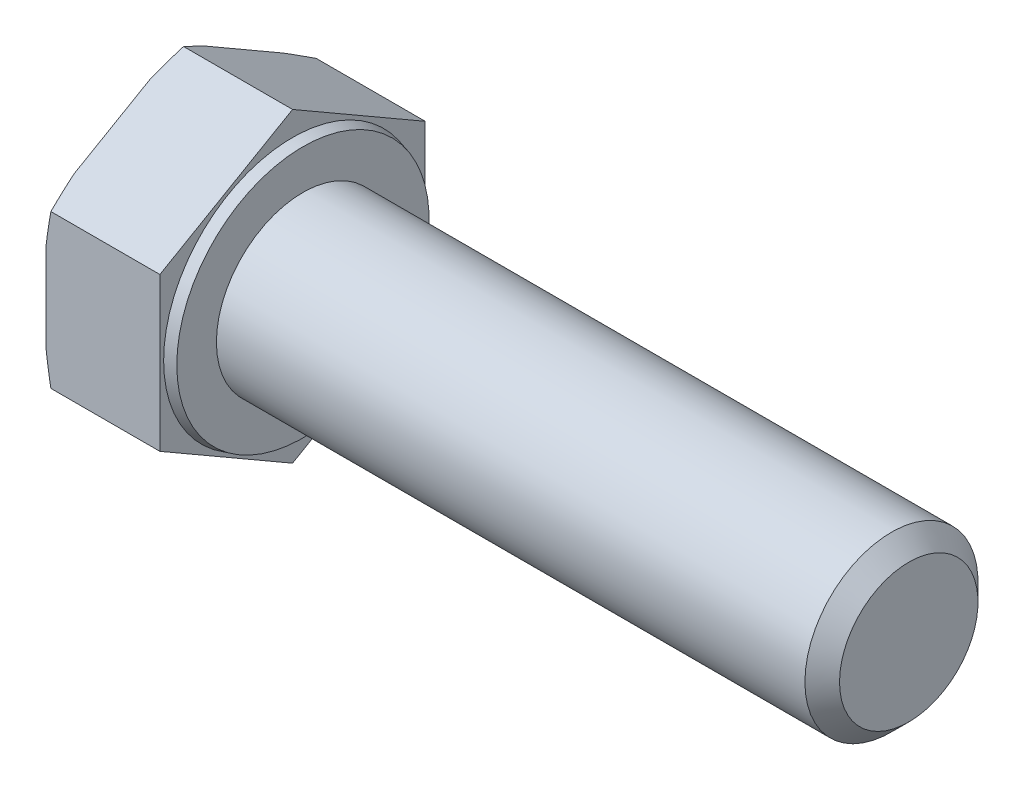
ISO-10303-21;
HEADER;
FILE_DESCRIPTION(('STEP AP214'),'2;1');
FILE_NAME('part.step','',(''),(''),'','','');
FILE_SCHEMA(('AUTOMOTIVE_DESIGN { 1 0 10303 214 1 1 1 1 }'));
ENDSEC;
DATA;
#1=APPLICATION_CONTEXT('core data for automotive mechanical design processes');
#2=APPLICATION_PROTOCOL_DEFINITION('international standard','automotive_design',2000,#1);
#3=PRODUCT_CONTEXT('',#1,'mechanical');
#4=PRODUCT('Part','Part','',(#3));
#5=PRODUCT_RELATED_PRODUCT_CATEGORY('part','',(#4));
#6=PRODUCT_DEFINITION_FORMATION('','',#4);
#7=PRODUCT_DEFINITION_CONTEXT('part definition',#1,'design');
#8=PRODUCT_DEFINITION('design','',#6,#7);
#9=PRODUCT_DEFINITION_SHAPE('','',#8);
#10=(LENGTH_UNIT() NAMED_UNIT(*) SI_UNIT(.MILLI.,.METRE.));
#11=(NAMED_UNIT(*) PLANE_ANGLE_UNIT() SI_UNIT($,.RADIAN.));
#12=(NAMED_UNIT(*) SI_UNIT($,.STERADIAN.) SOLID_ANGLE_UNIT());
#13=UNCERTAINTY_MEASURE_WITH_UNIT(LENGTH_MEASURE(1.E-05),#10,'distance_accuracy_value','');
#14=(GEOMETRIC_REPRESENTATION_CONTEXT(3) GLOBAL_UNCERTAINTY_ASSIGNED_CONTEXT((#13)) GLOBAL_UNIT_ASSIGNED_CONTEXT((#10,
#11,#12)) REPRESENTATION_CONTEXT('',''));
#15=CARTESIAN_POINT('',(0.,0.,0.));
#16=DIRECTION('',(0.,0.,1.));
#17=DIRECTION('',(1.,0.,0.));
#18=AXIS2_PLACEMENT_3D('',#15,#16,#17);
#19=CARTESIAN_POINT('',(35.6000000000001,-4.42500000000009,-7.66432482349223));
#20=DIRECTION('',(0.,-0.866025403784442,-0.499999999999995));
#21=DIRECTION('',(0.,0.499999999999995,-0.866025403784442));
#22=AXIS2_PLACEMENT_3D('',#19,#20,#21);
#23=PLANE('',#22);
#24=DIRECTION('',(-1.,0.,0.));
#25=VECTOR('',#24,1.);
#26=CARTESIAN_POINT('',(35.6000000000001,-8.85,0.));
#27=LINE('',#26,#25);
#28=CARTESIAN_POINT('',(0.,-8.85,0.));
#29=VERTEX_POINT('',#28);
#30=CARTESIAN_POINT('',(-6.29792306844368,-8.85,0.));
#31=VERTEX_POINT('',#30);
#32=EDGE_CURVE('E163',#29,#31,#27,.T.);
#33=ORIENTED_EDGE('',*,*,#32,.T.);
#34=CARTESIAN_POINT('',(-4.7699615006699,-11.9174022332107,5.3128965151713));
#35=CARTESIAN_POINT('',(-4.83614833570257,-11.8050473190038,5.11829209528478));
#36=CARTESIAN_POINT('',(-4.90167255003095,-11.6925948603644,4.92351872348535));
#37=CARTESIAN_POINT('',(-5.03118559698242,-11.4674663528304,4.53358471020429));
#38=CARTESIAN_POINT('',(-5.09517439305191,-11.3547902986816,4.33842405962226));
#39=CARTESIAN_POINT('',(-5.28456041407138,-11.0163157536771,3.75216895060564));
#40=CARTESIAN_POINT('',(-5.40733223857273,-10.7901468045143,3.3604328395613));
#41=CARTESIAN_POINT('',(-5.64480594732521,-10.3342684187143,2.57082831328319));
#42=CARTESIAN_POINT('',(-5.75941225873481,-10.1045464495324,2.17293819104533));
#43=CARTESIAN_POINT('',(-5.97591685440881,-9.6436033227612,1.37456127607789));
#44=CARTESIAN_POINT('',(-6.07781581130404,-9.41238224520544,0.974074621970502));
#45=CARTESIAN_POINT('',(-6.26134144326315,-8.95638364479248,0.184261877874948));
#46=CARTESIAN_POINT('',(-6.34355573274743,-8.73166601658844,-0.204960471530833));
#47=CARTESIAN_POINT('',(-6.48746045966098,-8.28055127837509,-0.986314118159495));
#48=CARTESIAN_POINT('',(-6.54915189984519,-8.05415425097466,-1.37844527229962));
#49=CARTESIAN_POINT('',(-6.62254434564547,-7.71410474496151,-1.9674282938031));
#50=CARTESIAN_POINT('',(-6.64378861584913,-7.60095958105454,-2.16340146632069));
#51=CARTESIAN_POINT('',(-6.67950592063896,-7.37440457175731,-2.55580625313272));
#52=CARTESIAN_POINT('',(-6.69397933196105,-7.26099474144627,-2.75223784130922));
#53=CARTESIAN_POINT('',(-6.7157765759338,-7.03401139991638,-3.14538452131075));
#54=CARTESIAN_POINT('',(-6.72310096885371,-6.92043790222291,-3.34209958970915));
#55=CARTESIAN_POINT('',(-6.73040192529392,-6.69323186195545,-3.73563199523894));
#56=CARTESIAN_POINT('',(-6.73037853713207,-6.57959931977464,-3.93244933168932));
#57=CARTESIAN_POINT('',(-6.72320871548941,-6.35929562962563,-4.31402651612232));
#58=CARTESIAN_POINT('',(-6.71649505277964,-6.25262090601261,-4.49879255730344));
#59=CARTESIAN_POINT('',(-6.69675463432834,-6.03941600442701,-4.86807427927243));
#60=CARTESIAN_POINT('',(-6.68372760236287,-5.93288583298343,-5.05258994875173));
#61=CARTESIAN_POINT('',(-6.63559663675346,-5.61363013252953,-5.60555704254388));
#62=CARTESIAN_POINT('',(-6.59144268713134,-5.40123548697151,-5.97343535990596));
#63=CARTESIAN_POINT('',(-6.48226269320506,-4.97681311893132,-6.70855646522027));
#64=CARTESIAN_POINT('',(-6.41713860156276,-4.7647919199632,-7.07578795411474));
#65=CARTESIAN_POINT('',(-6.27018625376656,-4.34222339340586,-7.80769811179158));
#66=CARTESIAN_POINT('',(-6.18835790112246,-4.1316760743376,-8.17237676581522));
#67=CARTESIAN_POINT('',(-6.00866271800198,-3.70472589760515,-8.91187616421634));
#68=CARTESIAN_POINT('',(-5.91033992742069,-3.48837165185492,-9.286612710289));
#69=CARTESIAN_POINT('',(-5.70311989656312,-3.05693413716248,-10.0338844060276));
#70=CARTESIAN_POINT('',(-5.59422212603359,-2.84185093252738,-10.4064194443103));
#71=CARTESIAN_POINT('',(-5.36943684134144,-2.41473283183158,-11.1462096955477));
#72=CARTESIAN_POINT('',(-5.25362330968472,-2.2026881429877,-11.5134818701005));
#73=CARTESIAN_POINT('',(-5.07537550670142,-1.88529185166037,-12.0632283728134));
#74=CARTESIAN_POINT('',(-5.01521325258259,-1.77961882394802,-12.2462594258008));
#75=CARTESIAN_POINT('',(-4.89354912869936,-1.56846779942573,-12.6119837283436));
#76=CARTESIAN_POINT('',(-4.83204728425027,-1.462989798971,-12.794676984212));
#77=CARTESIAN_POINT('',(-4.7699615006699,-1.35759776678936,-12.9772213386635));
#78=B_SPLINE_CURVE_WITH_KNOTS('',3,(#34,#35,#36,#37,#38,#39,#40,#41,#42,#43,#44,#45,#46,#47,#48,
#49,#50,#51,#52,#53,#54,#55,#56,#57,#58,#59,#60,#61,#62,#63,#64,#65,#66,#67,#68,#69,#70,#71,#72,
#73,#74,#75,#76,#77),.UNSPECIFIED.,.F.,.F.,(4,2,2,2,2,2,2,2,2,2,2,2,2,2,2,2,2,2,2,2,2,4),(0.,
0.70276173034238,1.40554017472233,2.81157217612387,4.23201032618944,5.6523732571052,
7.02270828812482,8.39297635416767,9.07474696516834,9.75647963740092,10.438158877887,
11.119833635759,11.7601005309412,12.4003954417532,13.6809617128842,14.9676044823533,
16.2542546841746,17.5852978857349,18.9164078632869,20.2352036230902,20.894426976119,
21.553637882061),.UNSPECIFIED.);
#79=CARTESIAN_POINT('',(-6.58000000000003,-7.90869530364146,-1.63038755949604));
#80=VERTEX_POINT('',#79);
#81=EDGE_CURVE('E208',#31,#80,#78,.T.);
#82=ORIENTED_EDGE('',*,*,#81,.T.);
#83=DIRECTION('',(0.,-0.499999999999995,0.866025403784442));
#84=VECTOR('',#83,1.);
#85=CARTESIAN_POINT('',(-6.58,-4.42500000000009,-7.66432482349223));
#86=LINE('',#85,#84);
#87=CARTESIAN_POINT('',(-6.58,-5.36630469635854,-6.03393726399618));
#88=VERTEX_POINT('',#87);
#89=EDGE_CURVE('E218',#88,#80,#86,.T.);
#90=ORIENTED_EDGE('',*,*,#89,.F.);
#91=CARTESIAN_POINT('',(-6.29792306844368,-4.42500000000009,-7.66432482349223));
#92=VERTEX_POINT('',#91);
#93=EDGE_CURVE('E221',#88,#92,#78,.T.);
#94=ORIENTED_EDGE('',*,*,#93,.T.);
#95=DIRECTION('',(-1.,0.,0.));
#96=VECTOR('',#95,1.);
#97=CARTESIAN_POINT('',(35.6000000000001,-4.42500000000009,-7.66432482349223));
#98=LINE('',#97,#96);
#99=CARTESIAN_POINT('',(0.,-4.42500000000009,-7.66432482349223));
#100=VERTEX_POINT('',#99);
#101=EDGE_CURVE('E174',#100,#92,#98,.T.);
#102=ORIENTED_EDGE('',*,*,#101,.F.);
#103=DIRECTION('',(0.,-0.499999999999995,0.866025403784442));
#104=VECTOR('',#103,1.);
#105=CARTESIAN_POINT('',(0.,-4.42500000000009,-7.66432482349223));
#106=LINE('',#105,#104);
#107=EDGE_CURVE('E189',#100,#29,#106,.T.);
#108=ORIENTED_EDGE('',*,*,#107,.T.);
#109=EDGE_LOOP('',(#33,#82,#90,#94,#102,#108));
#110=FACE_BOUND('',#109,.T.);
#111=ADVANCED_FACE('F41',(#110),#23,.T.);
#112=CARTESIAN_POINT('',(35.6000000000001,4.42499999999993,-7.66432482349232));
#113=DIRECTION('',(0.,0.,-1.));
#114=DIRECTION('',(0.,1.,0.));
#115=AXIS2_PLACEMENT_3D('',#112,#113,#114);
#116=PLANE('',#115);
#117=ORIENTED_EDGE('',*,*,#101,.T.);
#118=CARTESIAN_POINT('',(-5.00864005639831,-9.73789651517145,-7.66432482349217));
#119=CARTESIAN_POINT('',(-5.07003318744064,-9.52322769233334,-7.66432482349218));
#120=CARTESIAN_POINT('',(-5.13071664914256,-9.30835600664128,-7.66432482349218));
#121=CARTESIAN_POINT('',(-5.2504442425723,-8.87815277711283,-7.66432482349218));
#122=CARTESIAN_POINT('',(-5.30948834652955,-8.66282122555281,-7.66432482349219));
#123=CARTESIAN_POINT('',(-5.48387527888684,-8.01589307910885,-7.66432482349219));
#124=CARTESIAN_POINT('',(-5.59642298983084,-7.58353558067021,-7.6643248234922));
#125=CARTESIAN_POINT('',(-5.81266226723173,-6.71259000391773,-7.66432482349221));
#126=CARTESIAN_POINT('',(-5.91626806915323,-6.27398046842187,-7.66432482349221));
#127=CARTESIAN_POINT('',(-6.11029091280608,-5.39384656433909,-7.66432482349222));
#128=CARTESIAN_POINT('',(-6.20070892550878,-4.95232241284974,-7.66432482349222));
#129=CARTESIAN_POINT('',(-6.36160933963008,-4.08051166755351,-7.66432482349223));
#130=CARTESIAN_POINT('',(-6.43264625776086,-3.65032885049375,-7.66432482349224));
#131=CARTESIAN_POINT('',(-6.55428187483288,-2.78707107422335,-7.66432482349225));
#132=CARTESIAN_POINT('',(-6.60488453148917,-2.35399669158535,-7.66432482349225));
#133=CARTESIAN_POINT('',(-6.66240831794471,-1.70368188145931,-7.66432482349226));
#134=CARTESIAN_POINT('',(-6.67850532779577,-1.48723464984804,-7.66432482349226));
#135=CARTESIAN_POINT('',(-6.70429433272965,-1.05396299728827,-7.66432482349227));
#136=CARTESIAN_POINT('',(-6.71398664875919,-0.837138595786226,-7.66432482349227));
#137=CARTESIAN_POINT('',(-6.72672253024382,-0.403302294793051,-7.66432482349227));
#138=CARTESIAN_POINT('',(-6.72976638437883,-0.186290403852155,-7.66432482349227));
#139=CARTESIAN_POINT('',(-6.7291358967764,0.247718950123678,-7.66432482349228));
#140=CARTESIAN_POINT('',(-6.72546155695146,0.464716413162706,-7.66432482349228));
#141=CARTESIAN_POINT('',(-6.70624362970486,1.06036953223341,-7.66432482349229));
#142=CARTESIAN_POINT('',(-6.68388895075078,1.43882252598365,-7.66432482349229));
#143=CARTESIAN_POINT('',(-6.62050559151052,2.19412494594648,-7.6643248234923));
#144=CARTESIAN_POINT('',(-6.57947609181733,2.57097430106276,-7.6643248234923));
#145=CARTESIAN_POINT('',(-6.48113797206862,3.32388976987407,-7.66432482349231));
#146=CARTESIAN_POINT('',(-6.4237712185853,3.69994816672772,-7.66432482349232));
#147=CARTESIAN_POINT('',(-6.2956564145037,4.44978573942378,-7.66432482349232));
#148=CARTESIAN_POINT('',(-6.22490691200718,4.82356466341955,-7.66432482349233));
#149=CARTESIAN_POINT('',(-6.0704014797458,5.58003633732887,-7.66432482349234));
#150=CARTESIAN_POINT('',(-5.98632024183774,5.96266195818458,-7.66432482349234));
#151=CARTESIAN_POINT('',(-5.80919867667365,6.72583533235177,-7.66432482349235));
#152=CARTESIAN_POINT('',(-5.71615790531566,7.10638298167437,-7.66432482349235));
#153=CARTESIAN_POINT('',(-5.52374117974904,7.86297645537245,-7.66432482349236));
#154=CARTESIAN_POINT('',(-5.42441511026811,8.23903503370974,-7.66432482349236));
#155=CARTESIAN_POINT('',(-5.27134102225385,8.80195695976291,-7.66432482349237));
#156=CARTESIAN_POINT('',(-5.21964171692946,8.98938164843282,-7.66432482349237));
#157=CARTESIAN_POINT('',(-5.11502150400523,9.36388780999383,-7.66432482349237));
#158=CARTESIAN_POINT('',(-5.06210060924165,9.55096928646908,-7.66432482349238));
#159=CARTESIAN_POINT('',(-5.00864005639831,9.73789651517129,-7.66432482349238));
#160=B_SPLINE_CURVE_WITH_KNOTS('',3,(#118,#119,#120,#121,#122,#123,#124,#125,#126,#127,#128,
#129,#130,#131,#132,#133,#134,#135,#136,#137,#138,#139,#140,#141,#142,#143,#144,#145,#146,#147,
#148,#149,#150,#151,#152,#153,#154,#155,#156,#157,#158,#159),.UNSPECIFIED.,.F.,.F.,(4,2,2,2,2,2,
2,2,2,2,2,2,2,2,2,2,2,2,2,2,4),(0.,0.669823290546161,1.33965792092904,2.67986595636369,
4.03175825312792,5.38355096443301,6.69120700403605,7.99860965473741,8.64966414612008,
9.300686009923,9.95167960543101,10.6026730156168,11.7394565125237,12.876289893615,
14.0172201663474,15.1582742899967,16.3334026116279,17.5085892114817,18.6753990362947,
19.2586689197893,19.8419326771629),.UNSPECIFIED.);
#161=CARTESIAN_POINT('',(-6.58000000000003,-2.54239060728318,-7.66432482349217));
#162=VERTEX_POINT('',#161);
#163=EDGE_CURVE('E229',#92,#162,#160,.T.);
#164=ORIENTED_EDGE('',*,*,#163,.T.);
#165=DIRECTION('',(0.,-1.,0.));
#166=VECTOR('',#165,1.);
#167=CARTESIAN_POINT('',(-6.58,4.42499999999993,-7.66432482349232));
#168=LINE('',#167,#166);
#169=CARTESIAN_POINT('',(-6.58,2.54239060728305,-7.6643248234923));
#170=VERTEX_POINT('',#169);
#171=EDGE_CURVE('E169',#170,#162,#168,.T.);
#172=ORIENTED_EDGE('',*,*,#171,.F.);
#173=CARTESIAN_POINT('',(-6.29792306844368,4.42499999999993,-7.66432482349233));
#174=VERTEX_POINT('',#173);
#175=EDGE_CURVE('E56',#170,#174,#160,.T.);
#176=ORIENTED_EDGE('',*,*,#175,.T.);
#177=DIRECTION('',(-1.,0.,0.));
#178=VECTOR('',#177,1.);
#179=CARTESIAN_POINT('',(35.6000000000001,4.42499999999993,-7.66432482349232));
#180=LINE('',#179,#178);
#181=CARTESIAN_POINT('',(0.,4.42499999999993,-7.66432482349232));
#182=VERTEX_POINT('',#181);
#183=EDGE_CURVE('E160',#182,#174,#180,.T.);
#184=ORIENTED_EDGE('',*,*,#183,.F.);
#185=DIRECTION('',(0.,-1.,0.));
#186=VECTOR('',#185,1.);
#187=CARTESIAN_POINT('',(0.,8.84999999999992,-7.66432482349237));
#188=LINE('',#187,#186);
#189=EDGE_CURVE('E187',#182,#100,#188,.T.);
#190=ORIENTED_EDGE('',*,*,#189,.T.);
#191=EDGE_LOOP('',(#117,#164,#172,#176,#184,#190));
#192=FACE_BOUND('',#191,.T.);
#193=ADVANCED_FACE('F256',(#192),#116,.T.);
#194=CARTESIAN_POINT('',(35.6000000000001,8.85,0.));
#195=DIRECTION('',(0.,0.866025403784434,-0.500000000000007));
#196=DIRECTION('',(0.,0.500000000000007,0.866025403784435));
#197=AXIS2_PLACEMENT_3D('',#194,#195,#196);
#198=PLANE('',#197);
#199=ORIENTED_EDGE('',*,*,#183,.T.);
#200=CARTESIAN_POINT('',(-4.76996150066986,1.35759776678906,-12.9772213386637));
#201=CARTESIAN_POINT('',(-4.83614833570253,1.46995268099604,-12.7826169187772));
#202=CARTESIAN_POINT('',(-4.90167255003091,1.58240513963541,-12.5878435469777));
#203=CARTESIAN_POINT('',(-5.03118559698238,1.80753364716942,-12.1979095336967));
#204=CARTESIAN_POINT('',(-5.09517439305187,1.92020970131819,-12.0027488831146));
#205=CARTESIAN_POINT('',(-5.28456041407135,2.25868424632273,-11.416493774098));
#206=CARTESIAN_POINT('',(-5.40733223857269,2.48485319548548,-11.0247576630537));
#207=CARTESIAN_POINT('',(-5.64480594732518,2.9407315812855,-10.2351531367756));
#208=CARTESIAN_POINT('',(-5.75941225873478,3.17045355046743,-9.83726301453771));
#209=CARTESIAN_POINT('',(-5.97591685440879,3.63139667723867,-9.03888609957028));
#210=CARTESIAN_POINT('',(-6.07781581130402,3.86261775479443,-8.63839944546289));
#211=CARTESIAN_POINT('',(-6.26134144326313,4.3186163552074,-7.84858670136733));
#212=CARTESIAN_POINT('',(-6.34355573274742,4.54333398341145,-7.45936435196155));
#213=CARTESIAN_POINT('',(-6.48746045966097,4.99444872162481,-6.67801070533289));
#214=CARTESIAN_POINT('',(-6.54915189984519,5.22084574902526,-6.28587955119277));
#215=CARTESIAN_POINT('',(-6.62254434564547,5.56089525503842,-5.69689652968929));
#216=CARTESIAN_POINT('',(-6.64378861584913,5.67404041894539,-5.5009233571717));
#217=CARTESIAN_POINT('',(-6.67950592063896,5.90059542824263,-5.10851857035966));
#218=CARTESIAN_POINT('',(-6.69397933196106,6.01400525855367,-4.91208698218317));
#219=CARTESIAN_POINT('',(-6.7157765759338,6.24098860008357,-4.51894030218163));
#220=CARTESIAN_POINT('',(-6.72310096885372,6.35456209777704,-4.32222523378324));
#221=CARTESIAN_POINT('',(-6.73040192529394,6.58176813804451,-3.92869282825345));
#222=CARTESIAN_POINT('',(-6.73037853713208,6.69540068022533,-3.73187549180306));
#223=CARTESIAN_POINT('',(-6.72320871548943,6.91570437037435,-3.35029830737006));
#224=CARTESIAN_POINT('',(-6.71649505277966,7.02237909398737,-3.16553226618893));
#225=CARTESIAN_POINT('',(-6.69675463432836,7.23558399557298,-2.79625054421994));
#226=CARTESIAN_POINT('',(-6.68372760236289,7.34211416701656,-2.61173487474064));
#227=CARTESIAN_POINT('',(-6.63559663675348,7.66136986747048,-2.05876778094847));
#228=CARTESIAN_POINT('',(-6.59144268713136,7.87376451302852,-1.69088946358639));
#229=CARTESIAN_POINT('',(-6.48226269320508,8.29818688106872,-0.955768358272066));
#230=CARTESIAN_POINT('',(-6.41713860156277,8.51020808003686,-0.588536869377593));
#231=CARTESIAN_POINT('',(-6.27018625376657,8.93277660659422,0.143373288299262));
#232=CARTESIAN_POINT('',(-6.18835790112246,9.14332392566248,0.508051942322906));
#233=CARTESIAN_POINT('',(-6.00866271800198,9.57027410239495,1.24755134072404));
#234=CARTESIAN_POINT('',(-5.91033992742068,9.7866283481452,1.62228788679671));
#235=CARTESIAN_POINT('',(-5.7031198965631,10.2180658628377,2.36955958253528));
#236=CARTESIAN_POINT('',(-5.59422212603357,10.4331490674728,2.74209462081801));
#237=CARTESIAN_POINT('',(-5.36943684134141,10.8602671681686,3.48188487205548));
#238=CARTESIAN_POINT('',(-5.25362330968469,11.0723118570125,3.84915704660823));
#239=CARTESIAN_POINT('',(-5.07537550670138,11.3897081483398,4.39890354932111));
#240=CARTESIAN_POINT('',(-5.01521325258256,11.4953811760522,4.58193460230855));
#241=CARTESIAN_POINT('',(-4.89354912869931,11.7065322005745,4.94765890485139));
#242=CARTESIAN_POINT('',(-4.83204728425022,11.8120102010292,5.13035216071975));
#243=CARTESIAN_POINT('',(-4.76996150066986,11.9174022332109,5.3128965151713));
#244=B_SPLINE_CURVE_WITH_KNOTS('',3,(#200,#201,#202,#203,#204,#205,#206,#207,#208,#209,#210,
#211,#212,#213,#214,#215,#216,#217,#218,#219,#220,#221,#222,#223,#224,#225,#226,#227,#228,#229,
#230,#231,#232,#233,#234,#235,#236,#237,#238,#239,#240,#241,#242,#243),.UNSPECIFIED.,.F.,.F.,(4,
2,2,2,2,2,2,2,2,2,2,2,2,2,2,2,2,2,2,2,2,4),(0.,0.702761730342389,1.40554017472235,
2.8115721761239,4.23201032618948,5.65237325710526,7.02270828812488,8.39297635416774,
9.07474696516842,9.75647963740101,10.4381588778871,11.1198336357591,11.7601005309413,
12.4003954417533,13.6809617128843,14.9676044823535,16.2542546841748,17.5852978857351,
18.9164078632872,20.2352036230905,20.8944269761194,21.5536378820613),.UNSPECIFIED.);
#245=CARTESIAN_POINT('',(-6.58000000000003,5.36630469635833,-6.03393726399625));
#246=VERTEX_POINT('',#245);
#247=EDGE_CURVE('E251',#174,#246,#244,.T.);
#248=ORIENTED_EDGE('',*,*,#247,.T.);
#249=DIRECTION('',(0.,-0.500000000000007,-0.866025403784435));
#250=VECTOR('',#249,1.);
#251=CARTESIAN_POINT('',(-6.58,8.85,0.));
#252=LINE('',#251,#250);
#253=CARTESIAN_POINT('',(-6.58,7.90869530364155,-1.63038755949607));
#254=VERTEX_POINT('',#253);
#255=EDGE_CURVE('E241',#254,#246,#252,.T.);
#256=ORIENTED_EDGE('',*,*,#255,.F.);
#257=CARTESIAN_POINT('',(-6.29792306844368,8.85,0.));
#258=VERTEX_POINT('',#257);
#259=EDGE_CURVE('E64',#254,#258,#244,.T.);
#260=ORIENTED_EDGE('',*,*,#259,.T.);
#261=DIRECTION('',(-1.,0.,0.));
#262=VECTOR('',#261,1.);
#263=CARTESIAN_POINT('',(35.6000000000001,8.85,0.));
#264=LINE('',#263,#262);
#265=CARTESIAN_POINT('',(0.,8.85,0.));
#266=VERTEX_POINT('',#265);
#267=EDGE_CURVE('E157',#266,#258,#264,.T.);
#268=ORIENTED_EDGE('',*,*,#267,.F.);
#269=DIRECTION('',(0.,-0.500000000000007,-0.866025403784435));
#270=VECTOR('',#269,1.);
#271=CARTESIAN_POINT('',(0.,8.85000000000003,0.));
#272=LINE('',#271,#270);
#273=EDGE_CURVE('E185',#266,#182,#272,.T.);
#274=ORIENTED_EDGE('',*,*,#273,.T.);
#275=EDGE_LOOP('',(#199,#248,#256,#260,#268,#274));
#276=FACE_BOUND('',#275,.T.);
#277=ADVANCED_FACE('F249',(#276),#198,.T.);
#278=CARTESIAN_POINT('',(35.6000000000001,4.42500000000004,7.66432482349226));
#279=DIRECTION('',(0.,0.866025403784442,0.499999999999995));
#280=DIRECTION('',(0.,-0.499999999999995,0.866025403784442));
#281=AXIS2_PLACEMENT_3D('',#278,#279,#280);
#282=PLANE('',#281);
#283=ORIENTED_EDGE('',*,*,#267,.T.);
#284=CARTESIAN_POINT('',(-4.76996150066987,11.9174022332108,-5.31289651517143));
#285=CARTESIAN_POINT('',(-4.83614833570254,11.8050473190038,-5.1182920952849));
#286=CARTESIAN_POINT('',(-4.90167255003092,11.6925948603644,-4.92351872348547));
#287=CARTESIAN_POINT('',(-5.03118559698239,11.4674663528304,-4.53358471020441));
#288=CARTESIAN_POINT('',(-5.09517439305188,11.3547902986817,-4.33842405962238));
#289=CARTESIAN_POINT('',(-5.28456041407136,11.0163157536771,-3.75216895060575));
#290=CARTESIAN_POINT('',(-5.40733223857271,10.7901468045144,-3.36043283956141));
#291=CARTESIAN_POINT('',(-5.64480594732519,10.3342684187144,-2.5708283132833));
#292=CARTESIAN_POINT('',(-5.75941225873479,10.1045464495324,-2.17293819104543));
#293=CARTESIAN_POINT('',(-5.9759168544088,9.64360332276122,-1.374561276078));
#294=CARTESIAN_POINT('',(-6.07781581130403,9.41238224520547,-0.974074621970604));
#295=CARTESIAN_POINT('',(-6.26134144326314,8.9563836447925,-0.184261877875045));
#296=CARTESIAN_POINT('',(-6.34355573274742,8.73166601658846,0.204960471530737));
#297=CARTESIAN_POINT('',(-6.48746045966097,8.28055127837511,0.986314118159404));
#298=CARTESIAN_POINT('',(-6.54915189984519,8.05415425097468,1.37844527229953));
#299=CARTESIAN_POINT('',(-6.62254434564547,7.71410474496152,1.96742829380302));
#300=CARTESIAN_POINT('',(-6.64378861584914,7.60095958105455,2.1634014663206));
#301=CARTESIAN_POINT('',(-6.67950592063896,7.37440457175732,2.55580625313264));
#302=CARTESIAN_POINT('',(-6.69397933196106,7.26099474144628,2.75223784130914));
#303=CARTESIAN_POINT('',(-6.7157765759338,7.03401139991639,3.14538452131068));
#304=CARTESIAN_POINT('',(-6.72310096885372,6.92043790222292,3.34209958970907));
#305=CARTESIAN_POINT('',(-6.73040192529394,6.69323186195546,3.73563199523886));
#306=CARTESIAN_POINT('',(-6.73037853713208,6.57959931977464,3.93244933168925));
#307=CARTESIAN_POINT('',(-6.72320871548943,6.35929562962563,4.31402651612225));
#308=CARTESIAN_POINT('',(-6.71649505277966,6.25262090601261,4.49879255730338));
#309=CARTESIAN_POINT('',(-6.69675463432836,6.03941600442701,4.86807427927237));
#310=CARTESIAN_POINT('',(-6.68372760236289,5.93288583298343,5.05258994875167));
#311=CARTESIAN_POINT('',(-6.63559663675348,5.61363013252952,5.60555704254384));
#312=CARTESIAN_POINT('',(-6.59144268713136,5.40123548697149,5.97343535990593));
#313=CARTESIAN_POINT('',(-6.48226269320508,4.9768131189313,6.70855646522025));
#314=CARTESIAN_POINT('',(-6.41713860156277,4.76479191996317,7.07578795411472));
#315=CARTESIAN_POINT('',(-6.27018625376657,4.34222339340582,7.80769811179158));
#316=CARTESIAN_POINT('',(-6.18835790112247,4.13167607433756,8.17237676581522));
#317=CARTESIAN_POINT('',(-6.00866271800198,3.70472589760511,8.91187616421636));
#318=CARTESIAN_POINT('',(-5.91033992742069,3.48837165185487,9.28661271028903));
#319=CARTESIAN_POINT('',(-5.70311989656311,3.05693413716242,10.0338844060276));
#320=CARTESIAN_POINT('',(-5.59422212603358,2.84185093252732,10.4064194443103));
#321=CARTESIAN_POINT('',(-5.36943684134142,2.41473283183151,11.1462096955478));
#322=CARTESIAN_POINT('',(-5.2536233096847,2.20268814298763,11.5134818701005));
#323=CARTESIAN_POINT('',(-5.07537550670139,1.88529185166029,12.0632283728134));
#324=CARTESIAN_POINT('',(-5.01521325258257,1.77961882394793,12.2462594258009));
#325=CARTESIAN_POINT('',(-4.89354912869933,1.56846779942564,12.6119837283437));
#326=CARTESIAN_POINT('',(-4.83204728425023,1.46298979897091,12.7946769842121));
#327=CARTESIAN_POINT('',(-4.76996150066987,1.35759776678926,12.9772213386636));
#328=B_SPLINE_CURVE_WITH_KNOTS('',3,(#284,#285,#286,#287,#288,#289,#290,#291,#292,#293,#294,
#295,#296,#297,#298,#299,#300,#301,#302,#303,#304,#305,#306,#307,#308,#309,#310,#311,#312,#313,
#314,#315,#316,#317,#318,#319,#320,#321,#322,#323,#324,#325,#326,#327),.UNSPECIFIED.,.F.,.F.,(4,
2,2,2,2,2,2,2,2,2,2,2,2,2,2,2,2,2,2,2,2,4),(0.,0.702761730342384,1.40554017472234,
2.81157217612389,4.23201032618947,5.65237325710524,7.02270828812486,8.39297635416772,
9.0747469651684,9.75647963740098,10.4381588778871,11.119833635759,11.7601005309412,
12.4003954417533,13.6809617128843,14.9676044823535,16.2542546841747,17.585297885735,
18.9164078632871,20.2352036230904,20.8944269761193,21.5536378820612),.UNSPECIFIED.);
#329=CARTESIAN_POINT('',(-6.58000000000003,7.90869530364148,1.63038755949594));
#330=VERTEX_POINT('',#329);
#331=EDGE_CURVE('E151',#258,#330,#328,.T.);
#332=ORIENTED_EDGE('',*,*,#331,.T.);
#333=DIRECTION('',(0.,0.499999999999995,-0.866025403784442));
#334=VECTOR('',#333,1.);
#335=CARTESIAN_POINT('',(-6.58,4.42500000000004,7.66432482349226));
#336=LINE('',#335,#334);
#337=CARTESIAN_POINT('',(-6.58,5.36630469635847,6.03393726399624));
#338=VERTEX_POINT('',#337);
#339=EDGE_CURVE('E150',#338,#330,#336,.T.);
#340=ORIENTED_EDGE('',*,*,#339,.F.);
#341=CARTESIAN_POINT('',(-6.29792306844368,4.42500000000004,7.66432482349226));
#342=VERTEX_POINT('',#341);
#343=EDGE_CURVE('E132',#338,#342,#328,.T.);
#344=ORIENTED_EDGE('',*,*,#343,.T.);
#345=DIRECTION('',(-1.,0.,0.));
#346=VECTOR('',#345,1.);
#347=CARTESIAN_POINT('',(35.6000000000001,4.42500000000004,7.66432482349226));
#348=LINE('',#347,#346);
#349=CARTESIAN_POINT('',(0.,4.42500000000004,7.66432482349226));
#350=VERTEX_POINT('',#349);
#351=EDGE_CURVE('E146',#350,#342,#348,.T.);
#352=ORIENTED_EDGE('',*,*,#351,.F.);
#353=DIRECTION('',(0.,0.499999999999995,-0.866025403784442));
#354=VECTOR('',#353,1.);
#355=CARTESIAN_POINT('',(0.,8.84999999999997,0.));
#356=LINE('',#355,#354);
#357=EDGE_CURVE('E183',#350,#266,#356,.T.);
#358=ORIENTED_EDGE('',*,*,#357,.T.);
#359=EDGE_LOOP('',(#283,#332,#340,#344,#352,#358));
#360=FACE_BOUND('',#359,.T.);
#361=ADVANCED_FACE('F145',(#360),#282,.T.);
#362=CARTESIAN_POINT('',(35.6000000000001,-4.42499999999998,7.66432482349229));
#363=DIRECTION('',(0.,0.,1.));
#364=DIRECTION('',(0.,-1.,0.));
#365=AXIS2_PLACEMENT_3D('',#362,#363,#364);
#366=PLANE('',#365);
#367=ORIENTED_EDGE('',*,*,#351,.T.);
#368=CARTESIAN_POINT('',(-5.00864005639831,9.7378965151714,7.66432482349224));
#369=CARTESIAN_POINT('',(-5.07003318744064,9.52322769233328,7.66432482349224));
#370=CARTESIAN_POINT('',(-5.13071664914256,9.30835600664122,7.66432482349224));
#371=CARTESIAN_POINT('',(-5.2504442425723,8.87815277711278,7.66432482349225));
#372=CARTESIAN_POINT('',(-5.30948834652955,8.66282122555276,7.66432482349225));
#373=CARTESIAN_POINT('',(-5.48387527888684,8.0158930791088,7.66432482349225));
#374=CARTESIAN_POINT('',(-5.59642298983084,7.58353558067016,7.66432482349225));
#375=CARTESIAN_POINT('',(-5.81266226723173,6.71259000391768,7.66432482349225));
#376=CARTESIAN_POINT('',(-5.91626806915323,6.27398046842182,7.66432482349225));
#377=CARTESIAN_POINT('',(-6.11029091280608,5.39384656433903,7.66432482349226));
#378=CARTESIAN_POINT('',(-6.20070892550878,4.95232241284969,7.66432482349226));
#379=CARTESIAN_POINT('',(-6.36160933963008,4.08051166755345,7.66432482349226));
#380=CARTESIAN_POINT('',(-6.43264625776087,3.6503288504937,7.66432482349226));
#381=CARTESIAN_POINT('',(-6.55428187483288,2.7870710742233,7.66432482349227));
#382=CARTESIAN_POINT('',(-6.60488453148917,2.3539966915853,7.66432482349227));
#383=CARTESIAN_POINT('',(-6.66240831794471,1.70368188145926,7.66432482349227));
#384=CARTESIAN_POINT('',(-6.67850532779577,1.48723464984798,7.66432482349227));
#385=CARTESIAN_POINT('',(-6.70429433272965,1.05396299728821,7.66432482349227));
#386=CARTESIAN_POINT('',(-6.71398664875919,0.83713859578617,7.66432482349227));
#387=CARTESIAN_POINT('',(-6.72672253024382,0.403302294792995,7.66432482349227));
#388=CARTESIAN_POINT('',(-6.72976638437883,0.1862904038521,7.66432482349228));
#389=CARTESIAN_POINT('',(-6.7291358967764,-0.247718950123733,7.66432482349228));
#390=CARTESIAN_POINT('',(-6.72546155695146,-0.46471641316276,7.66432482349228));
#391=CARTESIAN_POINT('',(-6.70624362970486,-1.06036953223346,7.66432482349228));
#392=CARTESIAN_POINT('',(-6.68388895075078,-1.43882252598371,7.66432482349228));
#393=CARTESIAN_POINT('',(-6.62050559151052,-2.19412494594653,7.66432482349228));
#394=CARTESIAN_POINT('',(-6.57947609181733,-2.57097430106281,7.66432482349229));
#395=CARTESIAN_POINT('',(-6.48113797206862,-3.32388976987413,7.66432482349229));
#396=CARTESIAN_POINT('',(-6.4237712185853,-3.69994816672777,7.66432482349229));
#397=CARTESIAN_POINT('',(-6.2956564145037,-4.44978573942384,7.66432482349229));
#398=CARTESIAN_POINT('',(-6.22490691200718,-4.8235646634196,7.66432482349229));
#399=CARTESIAN_POINT('',(-6.0704014797458,-5.58003633732892,7.6643248234923));
#400=CARTESIAN_POINT('',(-5.98632024183774,-5.96266195818463,7.6643248234923));
#401=CARTESIAN_POINT('',(-5.80919867667365,-6.72583533235183,7.6643248234923));
#402=CARTESIAN_POINT('',(-5.71615790531566,-7.10638298167442,7.6643248234923));
#403=CARTESIAN_POINT('',(-5.52374117974904,-7.8629764553725,7.66432482349231));
#404=CARTESIAN_POINT('',(-5.42441511026811,-8.2390350337098,7.66432482349231));
#405=CARTESIAN_POINT('',(-5.27134102225385,-8.80195695976297,7.66432482349231));
#406=CARTESIAN_POINT('',(-5.21964171692946,-8.98938164843288,7.66432482349231));
#407=CARTESIAN_POINT('',(-5.11502150400523,-9.36388780999389,7.66432482349231));
#408=CARTESIAN_POINT('',(-5.06210060924165,-9.55096928646914,7.66432482349231));
#409=CARTESIAN_POINT('',(-5.00864005639831,-9.73789651517135,7.66432482349231));
#410=B_SPLINE_CURVE_WITH_KNOTS('',3,(#368,#369,#370,#371,#372,#373,#374,#375,#376,#377,#378,
#379,#380,#381,#382,#383,#384,#385,#386,#387,#388,#389,#390,#391,#392,#393,#394,#395,#396,#397,
#398,#399,#400,#401,#402,#403,#404,#405,#406,#407,#408,#409),.UNSPECIFIED.,.F.,.F.,(4,2,2,2,2,2,
2,2,2,2,2,2,2,2,2,2,2,2,2,2,4),(0.,0.669823290546161,1.33965792092904,2.67986595636369,
4.03175825312792,5.38355096443301,6.69120700403605,7.99860965473742,8.64966414612009,
9.300686009923,9.95167960543102,10.6026730156168,11.7394565125237,12.876289893615,
14.0172201663474,15.1582742899967,16.3334026116279,17.5085892114817,18.6753990362947,
19.2586689197893,19.8419326771629),.UNSPECIFIED.);
#411=CARTESIAN_POINT('',(-6.58000000000003,2.54239060728313,7.66432482349219));
#412=VERTEX_POINT('',#411);
#413=EDGE_CURVE('E129',#342,#412,#410,.T.);
#414=ORIENTED_EDGE('',*,*,#413,.T.);
#415=DIRECTION('',(0.,1.,0.));
#416=VECTOR('',#415,1.);
#417=CARTESIAN_POINT('',(-6.58,-4.42499999999998,7.66432482349229));
#418=LINE('',#417,#416);
#419=CARTESIAN_POINT('',(-6.58,-2.5423906072831,7.66432482349229));
#420=VERTEX_POINT('',#419);
#421=EDGE_CURVE('E227',#420,#412,#418,.T.);
#422=ORIENTED_EDGE('',*,*,#421,.F.);
#423=CARTESIAN_POINT('',(-6.29792306844368,-4.42499999999998,7.66432482349229));
#424=VERTEX_POINT('',#423);
#425=EDGE_CURVE('E139',#420,#424,#410,.T.);
#426=ORIENTED_EDGE('',*,*,#425,.T.);
#427=DIRECTION('',(-1.,0.,0.));
#428=VECTOR('',#427,1.);
#429=CARTESIAN_POINT('',(35.6000000000001,-4.42499999999998,7.66432482349229));
#430=LINE('',#429,#428);
#431=CARTESIAN_POINT('',(0.,-4.42499999999998,7.66432482349229));
#432=VERTEX_POINT('',#431);
#433=EDGE_CURVE('E158',#432,#424,#430,.T.);
#434=ORIENTED_EDGE('',*,*,#433,.F.);
#435=DIRECTION('',(0.,1.,0.));
#436=VECTOR('',#435,1.);
#437=CARTESIAN_POINT('',(0.,8.85000000000003,7.66432482349225));
#438=LINE('',#437,#436);
#439=EDGE_CURVE('E156',#432,#350,#438,.T.);
#440=ORIENTED_EDGE('',*,*,#439,.T.);
#441=EDGE_LOOP('',(#367,#414,#422,#426,#434,#440));
#442=FACE_BOUND('',#441,.T.);
#443=ADVANCED_FACE('F153',(#442),#366,.T.);
#444=CARTESIAN_POINT('',(35.6000000000001,-8.85,0.));
#445=DIRECTION('',(0.,-0.866025403784438,0.500000000000001));
#446=DIRECTION('',(0.,-0.500000000000001,-0.866025403784438));
#447=AXIS2_PLACEMENT_3D('',#444,#445,#446);
#448=PLANE('',#447);
#449=ORIENTED_EDGE('',*,*,#433,.T.);
#450=CARTESIAN_POINT('',(-4.76996150066987,-1.35759776678916,12.9772213386637));
#451=CARTESIAN_POINT('',(-4.83614833570253,-1.46995268099614,12.7826169187771));
#452=CARTESIAN_POINT('',(-4.90167255003091,-1.58240513963551,12.5878435469777));
#453=CARTESIAN_POINT('',(-5.03118559698239,-1.80753364716952,12.1979095336966));
#454=CARTESIAN_POINT('',(-5.09517439305187,-1.92020970131828,12.0027488831146));
#455=CARTESIAN_POINT('',(-5.28456041407135,-2.25868424632282,11.416493774098));
#456=CARTESIAN_POINT('',(-5.4073322385727,-2.48485319548557,11.0247576630537));
#457=CARTESIAN_POINT('',(-5.64480594732518,-2.94073158128559,10.2351531367755));
#458=CARTESIAN_POINT('',(-5.75941225873479,-3.17045355046751,9.83726301453767));
#459=CARTESIAN_POINT('',(-5.97591685440879,-3.63139667723874,9.03888609957024));
#460=CARTESIAN_POINT('',(-6.07781581130402,-3.8626177547945,8.63839944546285));
#461=CARTESIAN_POINT('',(-6.26134144326314,-4.31861635520747,7.84858670136729));
#462=CARTESIAN_POINT('',(-6.34355573274742,-4.54333398341151,7.45936435196151));
#463=CARTESIAN_POINT('',(-6.48746045966097,-4.99444872162487,6.67801070533285));
#464=CARTESIAN_POINT('',(-6.54915189984519,-5.22084574902531,6.28587955119273));
#465=CARTESIAN_POINT('',(-6.62254434564547,-5.56089525503846,5.69689652968924));
#466=CARTESIAN_POINT('',(-6.64378861584913,-5.67404041894544,5.50092335717165));
#467=CARTESIAN_POINT('',(-6.67950592063896,-5.90059542824267,5.10851857035961));
#468=CARTESIAN_POINT('',(-6.69397933196106,-6.01400525855371,4.91208698218312));
#469=CARTESIAN_POINT('',(-6.7157765759338,-6.24098860008361,4.51894030218158));
#470=CARTESIAN_POINT('',(-6.72310096885372,-6.35456209777708,4.32222523378319));
#471=CARTESIAN_POINT('',(-6.73040192529394,-6.58176813804454,3.92869282825339));
#472=CARTESIAN_POINT('',(-6.73037853713208,-6.69540068022536,3.73187549180301));
#473=CARTESIAN_POINT('',(-6.72320871548943,-6.91570437037438,3.35029830737001));
#474=CARTESIAN_POINT('',(-6.71649505277966,-7.0223790939874,3.16553226618888));
#475=CARTESIAN_POINT('',(-6.69675463432836,-7.235583995573,2.79625054421989));
#476=CARTESIAN_POINT('',(-6.68372760236289,-7.34211416701658,2.61173487474059));
#477=CARTESIAN_POINT('',(-6.63559663675348,-7.6613698674705,2.05876778094842));
#478=CARTESIAN_POINT('',(-6.59144268713136,-7.87376451302853,1.69088946358633));
#479=CARTESIAN_POINT('',(-6.48226269320508,-8.29818688106872,0.955768358272013));
#480=CARTESIAN_POINT('',(-6.41713860156277,-8.51020808003686,0.58853686937754));
#481=CARTESIAN_POINT('',(-6.27018625376657,-8.93277660659421,-0.143373288299316));
#482=CARTESIAN_POINT('',(-6.18835790112247,-9.14332392566247,-0.508051942322961));
#483=CARTESIAN_POINT('',(-6.00866271800198,-9.57027410239494,-1.2475513407241));
#484=CARTESIAN_POINT('',(-5.91033992742068,-9.78662834814518,-1.62228788679676));
#485=CARTESIAN_POINT('',(-5.70311989656311,-10.2180658628376,-2.36955958253533));
#486=CARTESIAN_POINT('',(-5.59422212603357,-10.4331490674727,-2.74209462081807));
#487=CARTESIAN_POINT('',(-5.36943684134142,-10.8602671681686,-3.48188487205554));
#488=CARTESIAN_POINT('',(-5.25362330968469,-11.0723118570124,-3.84915704660829));
#489=CARTESIAN_POINT('',(-5.07537550670139,-11.3897081483398,-4.39890354932117));
#490=CARTESIAN_POINT('',(-5.01521325258256,-11.4953811760521,-4.58193460230861));
#491=CARTESIAN_POINT('',(-4.89354912869932,-11.7065322005744,-4.94765890485144));
#492=CARTESIAN_POINT('',(-4.83204728425023,-11.8120102010292,-5.13035216071981));
#493=CARTESIAN_POINT('',(-4.76996150066987,-11.9174022332108,-5.31289651517136));
#494=B_SPLINE_CURVE_WITH_KNOTS('',3,(#450,#451,#452,#453,#454,#455,#456,#457,#458,#459,#460,
#461,#462,#463,#464,#465,#466,#467,#468,#469,#470,#471,#472,#473,#474,#475,#476,#477,#478,#479,
#480,#481,#482,#483,#484,#485,#486,#487,#488,#489,#490,#491,#492,#493),.UNSPECIFIED.,.F.,.F.,(4,
2,2,2,2,2,2,2,2,2,2,2,2,2,2,2,2,2,2,2,2,4),(0.,0.702761730342388,1.40554017472235,
2.81157217612389,4.23201032618948,5.65237325710525,7.02270828812487,8.39297635416773,
9.07474696516841,9.75647963740099,10.4381588778871,11.1198336357591,11.7601005309413,
12.4003954417533,13.6809617128843,14.9676044823535,16.2542546841747,17.5852978857351,
18.9164078632871,20.2352036230904,20.8944269761193,21.5536378820613),.UNSPECIFIED.);
#495=CARTESIAN_POINT('',(-6.58000000000003,-5.36630469635837,6.03393726399621));
#496=VERTEX_POINT('',#495);
#497=EDGE_CURVE('E219',#424,#496,#494,.T.);
#498=ORIENTED_EDGE('',*,*,#497,.T.);
#499=DIRECTION('',(0.,0.500000000000001,0.866025403784438));
#500=VECTOR('',#499,1.);
#501=CARTESIAN_POINT('',(-6.58,-8.85,0.));
#502=LINE('',#501,#500);
#503=CARTESIAN_POINT('',(-6.58,-7.90869530364156,1.63038755949602));
#504=VERTEX_POINT('',#503);
#505=EDGE_CURVE('E225',#504,#496,#502,.T.);
#506=ORIENTED_EDGE('',*,*,#505,.F.);
#507=EDGE_CURVE('E210',#504,#31,#494,.T.);
#508=ORIENTED_EDGE('',*,*,#507,.T.);
#509=ORIENTED_EDGE('',*,*,#32,.F.);
#510=DIRECTION('',(0.,0.500000000000001,0.866025403784438));
#511=VECTOR('',#510,1.);
#512=CARTESIAN_POINT('',(0.,-4.42499999999999,7.66432482349229));
#513=LINE('',#512,#511);
#514=EDGE_CURVE('E180',#29,#432,#513,.T.);
#515=ORIENTED_EDGE('',*,*,#514,.T.);
#516=EDGE_LOOP('',(#449,#498,#506,#508,#509,#515));
#517=FACE_BOUND('',#516,.T.);
#518=ADVANCED_FACE('F277',(#517),#448,.T.);
#519=CARTESIAN_POINT('',(-6.58,0.,0.));
#520=DIRECTION('',(1.,0.,0.));
#521=DIRECTION('',(0.,0.,-1.));
#522=AXIS2_PLACEMENT_3D('',#519,#520,#521);
#523=PLANE('',#522);
#524=CARTESIAN_POINT('',(-6.58,0.,0.));
#525=DIRECTION('',(1.,0.,0.));
#526=DIRECTION('',(0.,0.,-1.));
#527=AXIS2_PLACEMENT_3D('',#524,#525,#526);
#528=CIRCLE('',#527,8.07500000000009);
#529=EDGE_CURVE('E194',#170,#246,#528,.T.);
#530=ORIENTED_EDGE('',*,*,#529,.F.);
#531=ORIENTED_EDGE('',*,*,#171,.T.);
#532=EDGE_CURVE('E192',#88,#162,#528,.T.);
#533=ORIENTED_EDGE('',*,*,#532,.F.);
#534=ORIENTED_EDGE('',*,*,#89,.T.);
#535=EDGE_CURVE('E193',#504,#80,#528,.T.);
#536=ORIENTED_EDGE('',*,*,#535,.F.);
#537=ORIENTED_EDGE('',*,*,#505,.T.);
#538=EDGE_CURVE('E200',#420,#496,#528,.T.);
#539=ORIENTED_EDGE('',*,*,#538,.F.);
#540=ORIENTED_EDGE('',*,*,#421,.T.);
#541=CARTESIAN_POINT('',(-6.58000000000003,0.,0.));
#542=DIRECTION('',(-1.,0.,0.));
#543=DIRECTION('',(0.,0.,1.));
#544=AXIS2_PLACEMENT_3D('',#541,#542,#543);
#545=CIRCLE('',#544,8.075);
#546=EDGE_CURVE('E134',#412,#338,#545,.T.);
#547=ORIENTED_EDGE('',*,*,#546,.T.);
#548=ORIENTED_EDGE('',*,*,#339,.T.);
#549=EDGE_CURVE('E198',#254,#330,#528,.T.);
#550=ORIENTED_EDGE('',*,*,#549,.F.);
#551=ORIENTED_EDGE('',*,*,#255,.T.);
#552=EDGE_LOOP('',(#530,#531,#533,#534,#536,#537,#539,#540,#547,#548,#550,#551));
#553=FACE_BOUND('',#552,.T.);
#554=ADVANCED_FACE('F223',(#553),#523,.F.);
#555=CARTESIAN_POINT('',(0.,8.85,0.));
#556=DIRECTION('',(-1.,0.,0.));
#557=DIRECTION('',(0.,0.,1.));
#558=AXIS2_PLACEMENT_3D('',#555,#556,#557);
#559=PLANE('',#558);
#560=CARTESIAN_POINT('',(0.,0.,0.));
#561=DIRECTION('',(-1.,0.,0.));
#562=DIRECTION('',(0.,0.,1.));
#563=AXIS2_PLACEMENT_3D('',#560,#561,#562);
#564=CIRCLE('',#563,7.44897459621555);
#565=CARTESIAN_POINT('',(0.,0.,7.44897459621555));
#566=VERTEX_POINT('',#565);
#567=EDGE_CURVE('E177',#566,#566,#564,.T.);
#568=ORIENTED_EDGE('',*,*,#567,.T.);
#569=EDGE_LOOP('',(#568));
#570=FACE_BOUND('',#569,.T.);
#571=ORIENTED_EDGE('',*,*,#107,.F.);
#572=ORIENTED_EDGE('',*,*,#189,.F.);
#573=ORIENTED_EDGE('',*,*,#273,.F.);
#574=ORIENTED_EDGE('',*,*,#357,.F.);
#575=ORIENTED_EDGE('',*,*,#439,.F.);
#576=ORIENTED_EDGE('',*,*,#514,.F.);
#577=EDGE_LOOP('',(#571,#572,#573,#574,#575,#576));
#578=FACE_BOUND('',#577,.T.);
#579=ADVANCED_FACE('F261',(#570,#578),#559,.F.);
#580=CARTESIAN_POINT('',(0.599999999999934,0.,0.));
#581=DIRECTION('',(-1.,0.,0.));
#582=DIRECTION('',(0.,0.,1.));
#583=AXIS2_PLACEMENT_3D('',#580,#581,#582);
#584=CONICAL_SURFACE('',#583,7.28820508075687,0.261799387799175);
#585=ORIENTED_EDGE('',*,*,#567,.F.);
#586=EDGE_LOOP('',(#585));
#587=FACE_BOUND('',#586,.T.);
#588=CARTESIAN_POINT('',(0.599999999999934,0.,0.));
#589=DIRECTION('',(-1.,0.,0.));
#590=DIRECTION('',(0.,0.,1.));
#591=AXIS2_PLACEMENT_3D('',#588,#589,#590);
#592=CIRCLE('',#591,7.28820508075687);
#593=CARTESIAN_POINT('',(0.599999999999934,0.,7.28820508075687));
#594=VERTEX_POINT('',#593);
#595=EDGE_CURVE('E173',#594,#594,#592,.T.);
#596=ORIENTED_EDGE('',*,*,#595,.T.);
#597=EDGE_LOOP('',(#596));
#598=FACE_BOUND('',#597,.T.);
#599=ADVANCED_FACE('F330',(#587,#598),#584,.T.);
#600=CARTESIAN_POINT('',(0.6,7.28820508075687,0.));
#601=DIRECTION('',(-1.,0.,0.));
#602=DIRECTION('',(0.,0.,1.));
#603=AXIS2_PLACEMENT_3D('',#600,#601,#602);
#604=PLANE('',#603);
#605=ORIENTED_EDGE('',*,*,#595,.F.);
#606=EDGE_LOOP('',(#605));
#607=FACE_BOUND('',#606,.T.);
#608=CARTESIAN_POINT('',(0.599999999999934,0.,0.));
#609=DIRECTION('',(-1.,0.,0.));
#610=DIRECTION('',(0.,0.,1.));
#611=AXIS2_PLACEMENT_3D('',#608,#609,#610);
#612=CIRCLE('',#611,5.);
#613=CARTESIAN_POINT('',(0.599999999999934,0.,5.));
#614=VERTEX_POINT('',#613);
#615=EDGE_CURVE('E170',#614,#614,#612,.T.);
#616=ORIENTED_EDGE('',*,*,#615,.T.);
#617=EDGE_LOOP('',(#616));
#618=FACE_BOUND('',#617,.T.);
#619=ADVANCED_FACE('F327',(#607,#618),#604,.F.);
#620=CARTESIAN_POINT('',(-1000.,0.,0.));
#621=DIRECTION('',(-1.,0.,0.));
#622=DIRECTION('',(0.,0.,1.));
#623=AXIS2_PLACEMENT_3D('',#620,#621,#622);
#624=CYLINDRICAL_SURFACE('',#623,5.);
#625=CARTESIAN_POINT('',(34.6,0.,0.));
#626=DIRECTION('',(-1.,0.,0.));
#627=DIRECTION('',(0.,0.,1.));
#628=AXIS2_PLACEMENT_3D('',#625,#626,#627);
#629=CIRCLE('',#628,5.);
#630=CARTESIAN_POINT('',(34.6,0.,5.));
#631=VERTEX_POINT('',#630);
#632=EDGE_CURVE('E49',#631,#631,#629,.T.);
#633=ORIENTED_EDGE('',*,*,#632,.T.);
#634=EDGE_LOOP('',(#633));
#635=FACE_BOUND('',#634,.T.);
#636=ORIENTED_EDGE('',*,*,#615,.F.);
#637=EDGE_LOOP('',(#636));
#638=FACE_BOUND('',#637,.T.);
#639=ADVANCED_FACE('F323',(#635,#638),#624,.T.);
#640=CARTESIAN_POINT('',(35.6,5.,0.));
#641=DIRECTION('',(-1.,0.,0.));
#642=DIRECTION('',(0.,0.,1.));
#643=AXIS2_PLACEMENT_3D('',#640,#641,#642);
#644=PLANE('',#643);
#645=CARTESIAN_POINT('',(35.6,0.,0.));
#646=DIRECTION('',(-1.,0.,0.));
#647=DIRECTION('',(0.,0.,1.));
#648=AXIS2_PLACEMENT_3D('',#645,#646,#647);
#649=CIRCLE('',#648,4.0000000000001);
#650=CARTESIAN_POINT('',(35.6,0.,4.0000000000001));
#651=VERTEX_POINT('',#650);
#652=EDGE_CURVE('E12',#651,#651,#649,.F.);
#653=ORIENTED_EDGE('',*,*,#652,.T.);
#654=EDGE_LOOP('',(#653));
#655=FACE_BOUND('',#654,.T.);
#656=ADVANCED_FACE('F320',(#655),#644,.F.);
#657=CARTESIAN_POINT('',(-6.58000000000003,0.,0.));
#658=DIRECTION('',(1.,0.,0.));
#659=DIRECTION('',(0.,0.,-1.));
#660=AXIS2_PLACEMENT_3D('',#657,#658,#659);
#661=CONICAL_SURFACE('',#660,8.075,1.22173047639598);
#662=ORIENTED_EDGE('',*,*,#532,.T.);
#663=ORIENTED_EDGE('',*,*,#163,.F.);
#664=ORIENTED_EDGE('',*,*,#93,.F.);
#665=EDGE_LOOP('',(#662,#663,#664));
#666=FACE_BOUND('',#665,.T.);
#667=ADVANCED_FACE('F283',(#666),#661,.T.);
#668=ORIENTED_EDGE('',*,*,#507,.F.);
#669=ORIENTED_EDGE('',*,*,#535,.T.);
#670=ORIENTED_EDGE('',*,*,#81,.F.);
#671=EDGE_LOOP('',(#668,#669,#670));
#672=FACE_BOUND('',#671,.T.);
#673=ADVANCED_FACE('F207',(#672),#661,.T.);
#674=ORIENTED_EDGE('',*,*,#538,.T.);
#675=ORIENTED_EDGE('',*,*,#497,.F.);
#676=ORIENTED_EDGE('',*,*,#425,.F.);
#677=EDGE_LOOP('',(#674,#675,#676));
#678=FACE_BOUND('',#677,.T.);
#679=ADVANCED_FACE('F282',(#678),#661,.T.);
#680=ORIENTED_EDGE('',*,*,#546,.F.);
#681=ORIENTED_EDGE('',*,*,#413,.F.);
#682=ORIENTED_EDGE('',*,*,#343,.F.);
#683=EDGE_LOOP('',(#680,#681,#682));
#684=FACE_BOUND('',#683,.T.);
#685=ADVANCED_FACE('F131',(#684),#661,.T.);
#686=ORIENTED_EDGE('',*,*,#549,.T.);
#687=ORIENTED_EDGE('',*,*,#331,.F.);
#688=ORIENTED_EDGE('',*,*,#259,.F.);
#689=EDGE_LOOP('',(#686,#687,#688));
#690=FACE_BOUND('',#689,.T.);
#691=ADVANCED_FACE('F385',(#690),#661,.T.);
#692=ORIENTED_EDGE('',*,*,#529,.T.);
#693=ORIENTED_EDGE('',*,*,#247,.F.);
#694=ORIENTED_EDGE('',*,*,#175,.F.);
#695=EDGE_LOOP('',(#692,#693,#694));
#696=FACE_BOUND('',#695,.T.);
#697=ADVANCED_FACE('F369',(#696),#661,.T.);
#698=CARTESIAN_POINT('',(34.6,0.,0.));
#699=DIRECTION('',(-1.,0.,0.));
#700=DIRECTION('',(0.,0.,1.));
#701=AXIS2_PLACEMENT_3D('',#698,#699,#700);
#702=CONICAL_SURFACE('',#701,5.,0.785398163397375);
#703=ORIENTED_EDGE('',*,*,#652,.F.);
#704=EDGE_LOOP('',(#703));
#705=FACE_BOUND('',#704,.T.);
#706=ORIENTED_EDGE('',*,*,#632,.F.);
#707=EDGE_LOOP('',(#706));
#708=FACE_BOUND('',#707,.T.);
#709=ADVANCED_FACE('F43',(#705,#708),#702,.T.);
#710=CLOSED_SHELL('',(#111,#193,#277,#361,#443,#518,#554,#579,#599,#619,#639,#656,#667,#673,
#679,#685,#691,#697,#709));
#711=MANIFOLD_SOLID_BREP('B2',#710);
#712=ADVANCED_BREP_SHAPE_REPRESENTATION('',(#18,#711),#14);
#713=SHAPE_DEFINITION_REPRESENTATION(#9,#712);
ENDSEC;
END-ISO-10303-21;
